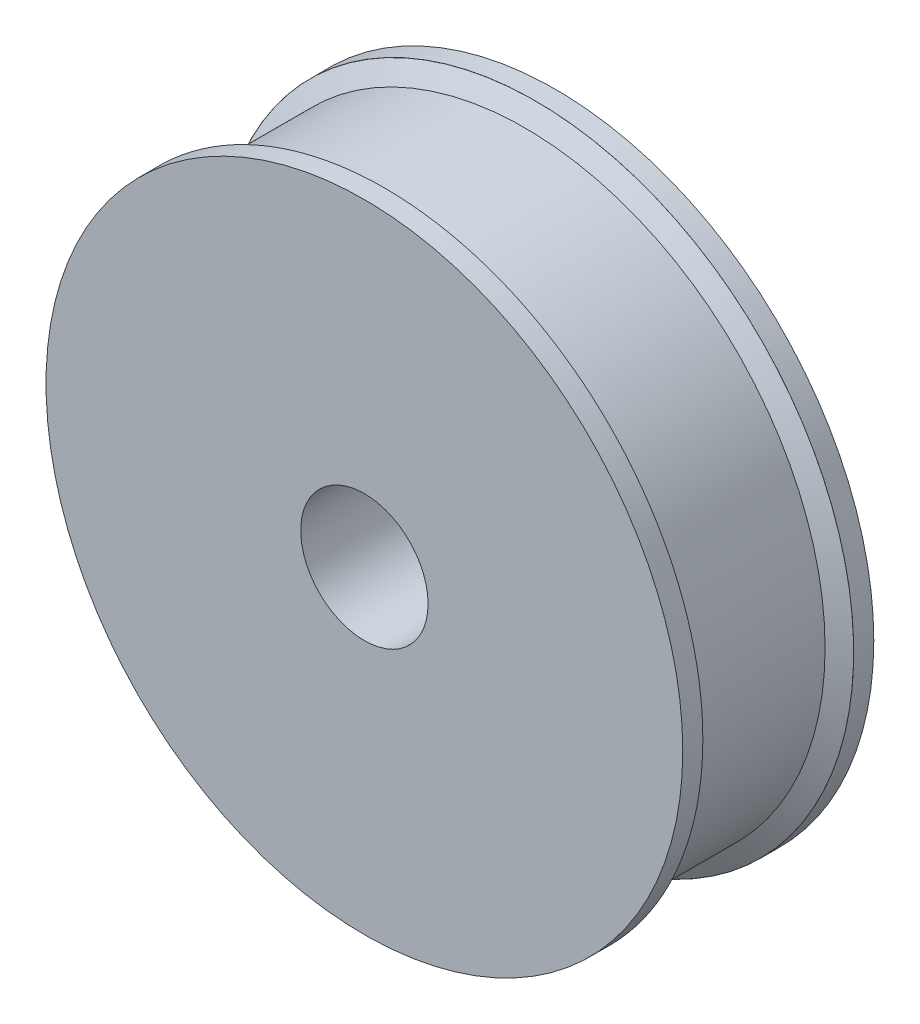
ISO-10303-21;
HEADER;
FILE_DESCRIPTION(('STEP AP214'),'2;1');
FILE_NAME('part.step','',(''),(''),'','','');
FILE_SCHEMA(('AUTOMOTIVE_DESIGN { 1 0 10303 214 1 1 1 1 }'));
ENDSEC;
DATA;
#1=APPLICATION_CONTEXT('core data for automotive mechanical design processes');
#2=APPLICATION_PROTOCOL_DEFINITION('international standard','automotive_design',2000,#1);
#3=PRODUCT_CONTEXT('',#1,'mechanical');
#4=PRODUCT('Part','Part','',(#3));
#5=PRODUCT_RELATED_PRODUCT_CATEGORY('part','',(#4));
#6=PRODUCT_DEFINITION_FORMATION('','',#4);
#7=PRODUCT_DEFINITION_CONTEXT('part definition',#1,'design');
#8=PRODUCT_DEFINITION('design','',#6,#7);
#9=PRODUCT_DEFINITION_SHAPE('','',#8);
#10=(LENGTH_UNIT() NAMED_UNIT(*) SI_UNIT(.MILLI.,.METRE.));
#11=(NAMED_UNIT(*) PLANE_ANGLE_UNIT() SI_UNIT($,.RADIAN.));
#12=(NAMED_UNIT(*) SI_UNIT($,.STERADIAN.) SOLID_ANGLE_UNIT());
#13=UNCERTAINTY_MEASURE_WITH_UNIT(LENGTH_MEASURE(1.E-05),#10,'distance_accuracy_value','');
#14=(GEOMETRIC_REPRESENTATION_CONTEXT(3) GLOBAL_UNCERTAINTY_ASSIGNED_CONTEXT((#13)) GLOBAL_UNIT_ASSIGNED_CONTEXT((#10,
#11,#12)) REPRESENTATION_CONTEXT('',''));
#15=CARTESIAN_POINT('',(0.,0.,0.));
#16=DIRECTION('',(0.,0.,1.));
#17=DIRECTION('',(1.,0.,0.));
#18=AXIS2_PLACEMENT_3D('',#15,#16,#17);
#19=CARTESIAN_POINT('',(0.,0.,19.05));
#20=DIRECTION('',(0.,0.,-1.));
#21=DIRECTION('',(-1.,0.,0.));
#22=AXIS2_PLACEMENT_3D('',#19,#20,#21);
#23=CYLINDRICAL_SURFACE('',#22,31.75);
#24=CARTESIAN_POINT('',(0.,0.,2.));
#25=DIRECTION('',(0.,0.,-1.));
#26=DIRECTION('',(-1.,0.,0.));
#27=AXIS2_PLACEMENT_3D('',#24,#25,#26);
#28=CIRCLE('',#27,31.75);
#29=CARTESIAN_POINT('',(-31.75,0.,2.));
#30=VERTEX_POINT('',#29);
#31=EDGE_CURVE('E35',#30,#30,#28,.T.);
#32=ORIENTED_EDGE('',*,*,#31,.T.);
#33=EDGE_LOOP('',(#32));
#34=FACE_BOUND('',#33,.T.);
#35=CARTESIAN_POINT('',(0.,0.,0.));
#36=DIRECTION('',(0.,0.,1.));
#37=DIRECTION('',(1.,0.,0.));
#38=AXIS2_PLACEMENT_3D('',#35,#36,#37);
#39=CIRCLE('',#38,31.75);
#40=CARTESIAN_POINT('',(31.75,0.,0.));
#41=VERTEX_POINT('',#40);
#42=EDGE_CURVE('E39',#41,#41,#39,.T.);
#43=ORIENTED_EDGE('',*,*,#42,.T.);
#44=EDGE_LOOP('',(#43));
#45=FACE_BOUND('',#44,.T.);
#46=ADVANCED_FACE('F31',(#34,#45),#23,.T.);
#47=CARTESIAN_POINT('',(0.,0.,19.05));
#48=DIRECTION('',(0.,0.,1.));
#49=DIRECTION('',(1.,0.,0.));
#50=AXIS2_PLACEMENT_3D('',#47,#48,#49);
#51=PLANE('',#50);
#52=CARTESIAN_POINT('',(0.,0.,19.05));
#53=DIRECTION('',(0.,0.,1.));
#54=DIRECTION('',(1.,0.,0.));
#55=AXIS2_PLACEMENT_3D('',#52,#53,#54);
#56=CIRCLE('',#55,31.75);
#57=CARTESIAN_POINT('',(31.75,0.,19.05));
#58=VERTEX_POINT('',#57);
#59=EDGE_CURVE('E10',#58,#58,#56,.T.);
#60=ORIENTED_EDGE('',*,*,#59,.T.);
#61=EDGE_LOOP('',(#60));
#62=FACE_BOUND('',#61,.T.);
#63=CARTESIAN_POINT('',(0.,0.,19.05));
#64=DIRECTION('',(0.,0.,1.));
#65=DIRECTION('',(1.,0.,0.));
#66=AXIS2_PLACEMENT_3D('',#63,#64,#65);
#67=CIRCLE('',#66,6.35);
#68=CARTESIAN_POINT('',(6.35,0.,19.05));
#69=VERTEX_POINT('',#68);
#70=EDGE_CURVE('E44',#69,#69,#67,.T.);
#71=ORIENTED_EDGE('',*,*,#70,.F.);
#72=EDGE_LOOP('',(#71));
#73=FACE_BOUND('',#72,.T.);
#74=ADVANCED_FACE('F85',(#62,#73),#51,.T.);
#75=CARTESIAN_POINT('',(0.,0.,0.));
#76=DIRECTION('',(0.,0.,1.));
#77=DIRECTION('',(1.,0.,0.));
#78=AXIS2_PLACEMENT_3D('',#75,#76,#77);
#79=PLANE('',#78);
#80=ORIENTED_EDGE('',*,*,#42,.F.);
#81=EDGE_LOOP('',(#80));
#82=FACE_BOUND('',#81,.T.);
#83=CARTESIAN_POINT('',(0.,0.,0.));
#84=DIRECTION('',(0.,0.,1.));
#85=DIRECTION('',(1.,0.,0.));
#86=AXIS2_PLACEMENT_3D('',#83,#84,#85);
#87=CIRCLE('',#86,6.35);
#88=CARTESIAN_POINT('',(6.35,0.,0.));
#89=VERTEX_POINT('',#88);
#90=EDGE_CURVE('E47',#89,#89,#87,.T.);
#91=ORIENTED_EDGE('',*,*,#90,.T.);
#92=EDGE_LOOP('',(#91));
#93=FACE_BOUND('',#92,.T.);
#94=ADVANCED_FACE('F70',(#82,#93),#79,.F.);
#95=CARTESIAN_POINT('',(0.,0.,17.05));
#96=DIRECTION('',(0.,0.,1.));
#97=DIRECTION('',(1.,0.,0.));
#98=AXIS2_PLACEMENT_3D('',#95,#96,#97);
#99=CIRCLE('',#98,31.75);
#100=CARTESIAN_POINT('',(31.75,0.,17.05));
#101=VERTEX_POINT('',#100);
#102=EDGE_CURVE('E49',#101,#101,#99,.T.);
#103=ORIENTED_EDGE('',*,*,#102,.T.);
#104=EDGE_LOOP('',(#103));
#105=FACE_BOUND('',#104,.T.);
#106=ORIENTED_EDGE('',*,*,#59,.F.);
#107=EDGE_LOOP('',(#106));
#108=FACE_BOUND('',#107,.T.);
#109=ADVANCED_FACE('F33',(#105,#108),#23,.T.);
#110=CARTESIAN_POINT('',(0.,0.,19.05));
#111=DIRECTION('',(0.,0.,-1.));
#112=DIRECTION('',(-1.,0.,0.));
#113=AXIS2_PLACEMENT_3D('',#110,#111,#112);
#114=CYLINDRICAL_SURFACE('',#113,6.35);
#115=ORIENTED_EDGE('',*,*,#70,.T.);
#116=EDGE_LOOP('',(#115));
#117=FACE_BOUND('',#116,.T.);
#118=ORIENTED_EDGE('',*,*,#90,.F.);
#119=EDGE_LOOP('',(#118));
#120=FACE_BOUND('',#119,.T.);
#121=ADVANCED_FACE('F72',(#117,#120),#114,.F.);
#122=CARTESIAN_POINT('',(0.,31.7407198226249,2.));
#123=DIRECTION('',(0.,0.,-1.));
#124=DIRECTION('',(-1.,0.,0.));
#125=AXIS2_PLACEMENT_3D('',#122,#123,#124);
#126=PLANE('',#125);
#127=CARTESIAN_POINT('',(0.,0.,2.));
#128=DIRECTION('',(0.,0.,-1.));
#129=DIRECTION('',(-1.,0.,0.));
#130=AXIS2_PLACEMENT_3D('',#127,#128,#129);
#131=CIRCLE('',#130,31.7407198226249);
#132=CARTESIAN_POINT('',(-31.7407198226249,0.,2.));
#133=VERTEX_POINT('',#132);
#134=EDGE_CURVE('E158',#133,#133,#131,.T.);
#135=ORIENTED_EDGE('',*,*,#134,.T.);
#136=EDGE_LOOP('',(#135));
#137=FACE_BOUND('',#136,.T.);
#138=ORIENTED_EDGE('',*,*,#31,.F.);
#139=EDGE_LOOP('',(#138));
#140=FACE_BOUND('',#139,.T.);
#141=ADVANCED_FACE('F74',(#137,#140),#126,.F.);
#142=CARTESIAN_POINT('',(0.,32.9349989999987,17.05));
#143=DIRECTION('',(0.,0.,1.));
#144=DIRECTION('',(1.,0.,0.));
#145=AXIS2_PLACEMENT_3D('',#142,#143,#144);
#146=PLANE('',#145);
#147=CARTESIAN_POINT('',(0.,0.,17.05));
#148=DIRECTION('',(0.,0.,-1.));
#149=DIRECTION('',(-1.,0.,0.));
#150=AXIS2_PLACEMENT_3D('',#147,#148,#149);
#151=CIRCLE('',#150,31.7407198226249);
#152=CARTESIAN_POINT('',(-31.7407198226249,0.,17.05));
#153=VERTEX_POINT('',#152);
#154=EDGE_CURVE('E51',#153,#153,#151,.T.);
#155=ORIENTED_EDGE('',*,*,#154,.F.);
#156=EDGE_LOOP('',(#155));
#157=FACE_BOUND('',#156,.T.);
#158=ORIENTED_EDGE('',*,*,#102,.F.);
#159=EDGE_LOOP('',(#158));
#160=FACE_BOUND('',#159,.T.);
#161=ADVANCED_FACE('F80',(#157,#160),#146,.F.);
#162=CARTESIAN_POINT('',(0.,0.,17.05));
#163=DIRECTION('',(0.,0.,1.));
#164=DIRECTION('',(1.,0.,0.));
#165=AXIS2_PLACEMENT_3D('',#162,#163,#164);
#166=CONICAL_SURFACE('',#165,31.7407198226249,1.0471975511966);
#167=CARTESIAN_POINT('',(0.,0.,16.0074665969755));
#168=DIRECTION('',(0.,0.,-1.));
#169=DIRECTION('',(-1.,0.,0.));
#170=AXIS2_PLACEMENT_3D('',#167,#168,#169);
#171=CIRCLE('',#170,29.9349989999987);
#172=CARTESIAN_POINT('',(-29.9349989999987,0.,16.0074665969755));
#173=VERTEX_POINT('',#172);
#174=EDGE_CURVE('E56',#173,#173,#171,.T.);
#175=ORIENTED_EDGE('',*,*,#174,.F.);
#176=EDGE_LOOP('',(#175));
#177=FACE_BOUND('',#176,.T.);
#178=ORIENTED_EDGE('',*,*,#154,.T.);
#179=EDGE_LOOP('',(#178));
#180=FACE_BOUND('',#179,.T.);
#181=ADVANCED_FACE('F121',(#177,#180),#166,.T.);
#182=CARTESIAN_POINT('',(0.,0.,0.));
#183=DIRECTION('',(0.,0.,-1.));
#184=DIRECTION('',(-1.,0.,0.));
#185=AXIS2_PLACEMENT_3D('',#182,#183,#184);
#186=CYLINDRICAL_SURFACE('',#185,29.9349989999987);
#187=CARTESIAN_POINT('',(0.,0.,3.04253340302453));
#188=DIRECTION('',(0.,0.,-1.));
#189=DIRECTION('',(-1.,0.,0.));
#190=AXIS2_PLACEMENT_3D('',#187,#188,#189);
#191=CIRCLE('',#190,29.9349989999987);
#192=CARTESIAN_POINT('',(-29.9349989999987,0.,3.04253340302453));
#193=VERTEX_POINT('',#192);
#194=EDGE_CURVE('E61',#193,#193,#191,.T.);
#195=ORIENTED_EDGE('',*,*,#194,.F.);
#196=EDGE_LOOP('',(#195));
#197=FACE_BOUND('',#196,.T.);
#198=ORIENTED_EDGE('',*,*,#174,.T.);
#199=EDGE_LOOP('',(#198));
#200=FACE_BOUND('',#199,.T.);
#201=ADVANCED_FACE('F131',(#197,#200),#186,.T.);
#202=CARTESIAN_POINT('',(0.,0.,3.04253340302453));
#203=DIRECTION('',(0.,0.,-1.));
#204=DIRECTION('',(-1.,0.,0.));
#205=AXIS2_PLACEMENT_3D('',#202,#203,#204);
#206=CONICAL_SURFACE('',#205,29.9349989999987,1.0471975511966);
#207=ORIENTED_EDGE('',*,*,#134,.F.);
#208=EDGE_LOOP('',(#207));
#209=FACE_BOUND('',#208,.T.);
#210=ORIENTED_EDGE('',*,*,#194,.T.);
#211=EDGE_LOOP('',(#210));
#212=FACE_BOUND('',#211,.T.);
#213=ADVANCED_FACE('F141',(#209,#212),#206,.T.);
#214=CLOSED_SHELL('',(#46,#74,#94,#109,#121,#141,#161,#181,#201,#213));
#215=MANIFOLD_SOLID_BREP('B2',#214);
#216=ADVANCED_BREP_SHAPE_REPRESENTATION('',(#18,#215),#14);
#217=SHAPE_DEFINITION_REPRESENTATION(#9,#216);
ENDSEC;
END-ISO-10303-21;
